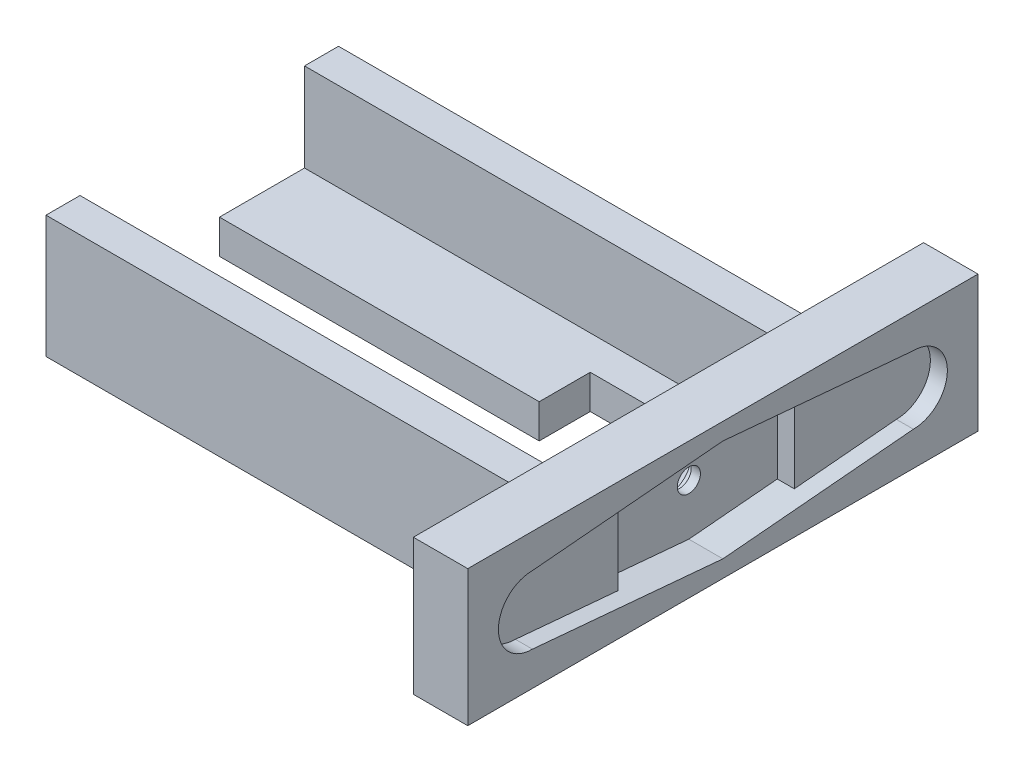
ISO-10303-21;
HEADER;
FILE_DESCRIPTION(('STEP AP214'),'2;1');
FILE_NAME('part.step','',(''),(''),'','','');
FILE_SCHEMA(('AUTOMOTIVE_DESIGN { 1 0 10303 214 1 1 1 1 }'));
ENDSEC;
DATA;
#1=APPLICATION_CONTEXT('core data for automotive mechanical design processes');
#2=APPLICATION_PROTOCOL_DEFINITION('international standard','automotive_design',2000,#1);
#3=PRODUCT_CONTEXT('',#1,'mechanical');
#4=PRODUCT('Part','Part','',(#3));
#5=PRODUCT_RELATED_PRODUCT_CATEGORY('part','',(#4));
#6=PRODUCT_DEFINITION_FORMATION('','',#4);
#7=PRODUCT_DEFINITION_CONTEXT('part definition',#1,'design');
#8=PRODUCT_DEFINITION('design','',#6,#7);
#9=PRODUCT_DEFINITION_SHAPE('','',#8);
#10=(LENGTH_UNIT() NAMED_UNIT(*) SI_UNIT(.MILLI.,.METRE.));
#11=(NAMED_UNIT(*) PLANE_ANGLE_UNIT() SI_UNIT($,.RADIAN.));
#12=(NAMED_UNIT(*) SI_UNIT($,.STERADIAN.) SOLID_ANGLE_UNIT());
#13=UNCERTAINTY_MEASURE_WITH_UNIT(LENGTH_MEASURE(1.E-05),#10,'distance_accuracy_value','');
#14=(GEOMETRIC_REPRESENTATION_CONTEXT(3) GLOBAL_UNCERTAINTY_ASSIGNED_CONTEXT((#13)) GLOBAL_UNIT_ASSIGNED_CONTEXT((#10,
#11,#12)) REPRESENTATION_CONTEXT('',''));
#15=CARTESIAN_POINT('',(0.,0.,0.));
#16=DIRECTION('',(0.,0.,1.));
#17=DIRECTION('',(1.,0.,0.));
#18=AXIS2_PLACEMENT_3D('',#15,#16,#17);
#19=CARTESIAN_POINT('',(-70.,-15.,-41.5));
#20=DIRECTION('',(0.,0.,-1.));
#21=DIRECTION('',(-1.,0.,0.));
#22=AXIS2_PLACEMENT_3D('',#19,#20,#21);
#23=PLANE('',#22);
#24=DIRECTION('',(1.,0.,0.));
#25=VECTOR('',#24,1.);
#26=CARTESIAN_POINT('',(0.,0.,-41.5));
#27=LINE('',#26,#25);
#28=CARTESIAN_POINT('',(-70.,0.,-41.5));
#29=VERTEX_POINT('',#28);
#30=CARTESIAN_POINT('',(-23.,0.,-41.5));
#31=VERTEX_POINT('',#30);
#32=EDGE_CURVE('E371',#29,#31,#27,.T.);
#33=ORIENTED_EDGE('',*,*,#32,.T.);
#34=DIRECTION('',(0.,1.,0.));
#35=VECTOR('',#34,1.);
#36=CARTESIAN_POINT('',(-23.,-15.,-41.5));
#37=LINE('',#36,#35);
#38=CARTESIAN_POINT('',(-23.,5.,-41.5));
#39=VERTEX_POINT('',#38);
#40=EDGE_CURVE('E335',#31,#39,#37,.T.);
#41=ORIENTED_EDGE('',*,*,#40,.T.);
#42=DIRECTION('',(-1.,0.,0.));
#43=VECTOR('',#42,1.);
#44=CARTESIAN_POINT('',(-70.,5.,-41.5));
#45=LINE('',#44,#43);
#46=CARTESIAN_POINT('',(-70.,5.,-41.5));
#47=VERTEX_POINT('',#46);
#48=EDGE_CURVE('E353',#39,#47,#45,.T.);
#49=ORIENTED_EDGE('',*,*,#48,.T.);
#50=DIRECTION('',(0.,-1.,0.));
#51=VECTOR('',#50,1.);
#52=CARTESIAN_POINT('',(-70.,0.,-41.5));
#53=LINE('',#52,#51);
#54=EDGE_CURVE('E614',#47,#29,#53,.T.);
#55=ORIENTED_EDGE('',*,*,#54,.T.);
#56=EDGE_LOOP('',(#33,#41,#49,#55));
#57=FACE_BOUND('',#56,.T.);
#58=ADVANCED_FACE('F55',(#57),#23,.F.);
#59=CARTESIAN_POINT('',(-70.,-15.,-33.5));
#60=DIRECTION('',(0.,0.,1.));
#61=DIRECTION('',(1.,0.,0.));
#62=AXIS2_PLACEMENT_3D('',#59,#60,#61);
#63=PLANE('',#62);
#64=DIRECTION('',(1.,0.,0.));
#65=VECTOR('',#64,1.);
#66=CARTESIAN_POINT('',(-70.,5.,-33.5));
#67=LINE('',#66,#65);
#68=CARTESIAN_POINT('',(-70.,5.,-33.5));
#69=VERTEX_POINT('',#68);
#70=CARTESIAN_POINT('',(-23.,5.,-33.5));
#71=VERTEX_POINT('',#70);
#72=EDGE_CURVE('E346',#69,#71,#67,.T.);
#73=ORIENTED_EDGE('',*,*,#72,.T.);
#74=DIRECTION('',(0.,-1.,0.));
#75=VECTOR('',#74,1.);
#76=CARTESIAN_POINT('',(-23.,-15.,-33.5));
#77=LINE('',#76,#75);
#78=CARTESIAN_POINT('',(-23.,0.,-33.5));
#79=VERTEX_POINT('',#78);
#80=EDGE_CURVE('E12',#71,#79,#77,.T.);
#81=ORIENTED_EDGE('',*,*,#80,.T.);
#82=DIRECTION('',(-1.,0.,0.));
#83=VECTOR('',#82,1.);
#84=CARTESIAN_POINT('',(0.,0.,-33.5));
#85=LINE('',#84,#83);
#86=CARTESIAN_POINT('',(-70.,0.,-33.5));
#87=VERTEX_POINT('',#86);
#88=EDGE_CURVE('E362',#79,#87,#85,.T.);
#89=ORIENTED_EDGE('',*,*,#88,.T.);
#90=DIRECTION('',(0.,1.,0.));
#91=VECTOR('',#90,1.);
#92=CARTESIAN_POINT('',(-70.,0.,-33.5));
#93=LINE('',#92,#91);
#94=EDGE_CURVE('E611',#87,#69,#93,.T.);
#95=ORIENTED_EDGE('',*,*,#94,.T.);
#96=EDGE_LOOP('',(#73,#81,#89,#95));
#97=FACE_BOUND('',#96,.T.);
#98=ADVANCED_FACE('F682',(#97),#63,.F.);
#99=CARTESIAN_POINT('',(-70.,0.,0.));
#100=DIRECTION('',(-1.,0.,0.));
#101=DIRECTION('',(0.,0.,1.));
#102=AXIS2_PLACEMENT_3D('',#99,#100,#101);
#103=PLANE('',#102);
#104=ORIENTED_EDGE('',*,*,#54,.F.);
#105=DIRECTION('',(0.,0.,-1.));
#106=VECTOR('',#105,1.);
#107=CARTESIAN_POINT('',(-70.,5.,-54.));
#108=LINE('',#107,#106);
#109=CARTESIAN_POINT('',(-70.,5.,-54.));
#110=VERTEX_POINT('',#109);
#111=EDGE_CURVE('E443',#47,#110,#108,.T.);
#112=ORIENTED_EDGE('',*,*,#111,.T.);
#113=DIRECTION('',(0.,1.,0.));
#114=VECTOR('',#113,1.);
#115=CARTESIAN_POINT('',(-70.,0.,-54.));
#116=LINE('',#115,#114);
#117=CARTESIAN_POINT('',(-70.,18.,-54.));
#118=VERTEX_POINT('',#117);
#119=EDGE_CURVE('E379',#110,#118,#116,.T.);
#120=ORIENTED_EDGE('',*,*,#119,.T.);
#121=DIRECTION('',(0.,0.,-1.));
#122=VECTOR('',#121,1.);
#123=CARTESIAN_POINT('',(-70.,18.,-54.));
#124=LINE('',#123,#122);
#125=CARTESIAN_POINT('',(-70.,18.,-59.));
#126=VERTEX_POINT('',#125);
#127=EDGE_CURVE('E382',#118,#126,#124,.T.);
#128=ORIENTED_EDGE('',*,*,#127,.T.);
#129=DIRECTION('',(0.,-1.,0.));
#130=VECTOR('',#129,1.);
#131=CARTESIAN_POINT('',(-70.,0.,-59.));
#132=LINE('',#131,#130);
#133=CARTESIAN_POINT('',(-70.,0.,-59.));
#134=VERTEX_POINT('',#133);
#135=EDGE_CURVE('E386',#126,#134,#132,.T.);
#136=ORIENTED_EDGE('',*,*,#135,.T.);
#137=DIRECTION('',(0.,0.,1.));
#138=VECTOR('',#137,1.);
#139=CARTESIAN_POINT('',(-70.,0.,-54.));
#140=LINE('',#139,#138);
#141=EDGE_CURVE('E439',#134,#29,#140,.T.);
#142=ORIENTED_EDGE('',*,*,#141,.T.);
#143=EDGE_LOOP('',(#104,#112,#120,#128,#136,#142));
#144=FACE_BOUND('',#143,.T.);
#145=ADVANCED_FACE('F651',(#144),#103,.T.);
#146=CARTESIAN_POINT('',(0.,20.,0.));
#147=DIRECTION('',(-1.,0.,0.));
#148=DIRECTION('',(0.,0.,1.));
#149=AXIS2_PLACEMENT_3D('',#146,#147,#148);
#150=PLANE('',#149);
#151=CARTESIAN_POINT('',(0.,10.,-37.5));
#152=DIRECTION('',(-1.,0.,0.));
#153=DIRECTION('',(0.,0.,1.));
#154=AXIS2_PLACEMENT_3D('',#151,#152,#153);
#155=CIRCLE('',#154,3.35);
#156=CARTESIAN_POINT('',(0.,10.,-34.15));
#157=VERTEX_POINT('',#156);
#158=EDGE_CURVE('E848',#157,#157,#155,.T.);
#159=ORIENTED_EDGE('',*,*,#158,.F.);
#160=EDGE_LOOP('',(#159));
#161=FACE_BOUND('',#160,.T.);
#162=DIRECTION('',(0.,0.,-1.));
#163=VECTOR('',#162,1.);
#164=CARTESIAN_POINT('',(0.,18.,-54.));
#165=LINE('',#164,#163);
#166=CARTESIAN_POINT('',(0.,18.,-54.));
#167=VERTEX_POINT('',#166);
#168=CARTESIAN_POINT('',(0.,18.,-59.));
#169=VERTEX_POINT('',#168);
#170=EDGE_CURVE('E393',#167,#169,#165,.T.);
#171=ORIENTED_EDGE('',*,*,#170,.F.);
#172=DIRECTION('',(0.,1.,0.));
#173=VECTOR('',#172,1.);
#174=CARTESIAN_POINT('',(0.,0.,-54.));
#175=LINE('',#174,#173);
#176=CARTESIAN_POINT('',(0.,5.,-54.));
#177=VERTEX_POINT('',#176);
#178=EDGE_CURVE('E378',#177,#167,#175,.T.);
#179=ORIENTED_EDGE('',*,*,#178,.F.);
#180=DIRECTION('',(0.,0.,-1.));
#181=VECTOR('',#180,1.);
#182=CARTESIAN_POINT('',(0.,5.,-54.));
#183=LINE('',#182,#181);
#184=CARTESIAN_POINT('',(0.,5.,-21.));
#185=VERTEX_POINT('',#184);
#186=EDGE_CURVE('E438',#185,#177,#183,.T.);
#187=ORIENTED_EDGE('',*,*,#186,.F.);
#188=DIRECTION('',(0.,-1.,0.));
#189=VECTOR('',#188,1.);
#190=CARTESIAN_POINT('',(0.,0.,-21.));
#191=LINE('',#190,#189);
#192=CARTESIAN_POINT('',(0.,18.,-21.));
#193=VERTEX_POINT('',#192);
#194=EDGE_CURVE('E409',#193,#185,#191,.T.);
#195=ORIENTED_EDGE('',*,*,#194,.F.);
#196=DIRECTION('',(0.,0.,-1.));
#197=VECTOR('',#196,1.);
#198=CARTESIAN_POINT('',(0.,18.,-21.));
#199=LINE('',#198,#197);
#200=CARTESIAN_POINT('',(0.,18.,-16.));
#201=VERTEX_POINT('',#200);
#202=EDGE_CURVE('E414',#201,#193,#199,.T.);
#203=ORIENTED_EDGE('',*,*,#202,.F.);
#204=DIRECTION('',(0.,1.,0.));
#205=VECTOR('',#204,1.);
#206=CARTESIAN_POINT('',(0.,0.,-16.));
#207=LINE('',#206,#205);
#208=CARTESIAN_POINT('',(0.,0.,-16.));
#209=VERTEX_POINT('',#208);
#210=EDGE_CURVE('E423',#209,#201,#207,.T.);
#211=ORIENTED_EDGE('',*,*,#210,.F.);
#212=DIRECTION('',(0.,0.,-1.));
#213=VECTOR('',#212,1.);
#214=CARTESIAN_POINT('',(0.,0.,0.));
#215=LINE('',#214,#213);
#216=CARTESIAN_POINT('',(0.,0.,0.));
#217=VERTEX_POINT('',#216);
#218=EDGE_CURVE('E588',#217,#209,#215,.T.);
#219=ORIENTED_EDGE('',*,*,#218,.F.);
#220=DIRECTION('',(0.,-1.,0.));
#221=VECTOR('',#220,1.);
#222=CARTESIAN_POINT('',(0.,20.,0.));
#223=LINE('',#222,#221);
#224=CARTESIAN_POINT('',(0.,20.,0.));
#225=VERTEX_POINT('',#224);
#226=EDGE_CURVE('E599',#225,#217,#223,.T.);
#227=ORIENTED_EDGE('',*,*,#226,.F.);
#228=DIRECTION('',(0.,0.,-1.));
#229=VECTOR('',#228,1.);
#230=CARTESIAN_POINT('',(0.,20.,0.));
#231=LINE('',#230,#229);
#232=CARTESIAN_POINT('',(0.,20.,-75.));
#233=VERTEX_POINT('',#232);
#234=EDGE_CURVE('E574',#225,#233,#231,.T.);
#235=ORIENTED_EDGE('',*,*,#234,.T.);
#236=DIRECTION('',(0.,-1.,0.));
#237=VECTOR('',#236,1.);
#238=CARTESIAN_POINT('',(0.,20.,-75.));
#239=LINE('',#238,#237);
#240=CARTESIAN_POINT('',(0.,0.,-75.));
#241=VERTEX_POINT('',#240);
#242=EDGE_CURVE('E587',#233,#241,#239,.T.);
#243=ORIENTED_EDGE('',*,*,#242,.T.);
#244=CARTESIAN_POINT('',(0.,0.,-59.));
#245=VERTEX_POINT('',#244);
#246=EDGE_CURVE('E573',#245,#241,#215,.T.);
#247=ORIENTED_EDGE('',*,*,#246,.F.);
#248=DIRECTION('',(0.,-1.,0.));
#249=VECTOR('',#248,1.);
#250=CARTESIAN_POINT('',(0.,0.,-59.));
#251=LINE('',#250,#249);
#252=EDGE_CURVE('E383',#169,#245,#251,.T.);
#253=ORIENTED_EDGE('',*,*,#252,.F.);
#254=EDGE_LOOP('',(#171,#179,#187,#195,#203,#211,#219,#227,#235,#243,#247,#253));
#255=FACE_BOUND('',#254,.T.);
#256=ADVANCED_FACE('F57',(#161,#255),#150,.T.);
#257=CARTESIAN_POINT('',(5.50000000000001,0.,0.));
#258=DIRECTION('',(1.,0.,0.));
#259=DIRECTION('',(0.,0.,-1.));
#260=AXIS2_PLACEMENT_3D('',#257,#258,#259);
#261=PLANE('',#260);
#262=DIRECTION('',(0.,-1.,0.));
#263=VECTOR('',#262,1.);
#264=CARTESIAN_POINT('',(5.50000000000001,0.,-24.551509830912));
#265=LINE('',#264,#263);
#266=CARTESIAN_POINT('',(5.50000000000001,16.3438848063314,-24.551509830912));
#267=VERTEX_POINT('',#266);
#268=CARTESIAN_POINT('',(5.50000000000001,3.65611519366857,-24.551509830912));
#269=VERTEX_POINT('',#268);
#270=EDGE_CURVE('E608',#267,#269,#265,.T.);
#271=ORIENTED_EDGE('',*,*,#270,.F.);
#272=DIRECTION('',(0.,0.0889319379745051,-0.996037705314462));
#273=VECTOR('',#272,1.);
#274=CARTESIAN_POINT('',(5.50000000000001,14.0398608035432,1.25355900031635));
#275=LINE('',#274,#273);
#276=CARTESIAN_POINT('',(5.50000000000001,15.,-9.5));
#277=VERTEX_POINT('',#276);
#278=EDGE_CURVE('E510',#277,#267,#275,.T.);
#279=ORIENTED_EDGE('',*,*,#278,.F.);
#280=CARTESIAN_POINT('',(5.50000000000001,10.,-9.5));
#281=DIRECTION('',(1.,0.,0.));
#282=DIRECTION('',(0.,0.,-1.));
#283=AXIS2_PLACEMENT_3D('',#280,#281,#282);
#284=CIRCLE('',#283,5.00000000000001);
#285=CARTESIAN_POINT('',(5.50000000000001,4.99999999999999,-9.5));
#286=VERTEX_POINT('',#285);
#287=EDGE_CURVE('E514',#286,#277,#284,.F.);
#288=ORIENTED_EDGE('',*,*,#287,.F.);
#289=DIRECTION('',(0.,0.0889319379745051,0.996037705314462));
#290=VECTOR('',#289,1.);
#291=CARTESIAN_POINT('',(5.50000000000001,5.80196140461878,-0.518032268269531));
#292=LINE('',#291,#290);
#293=EDGE_CURVE('E517',#269,#286,#292,.T.);
#294=ORIENTED_EDGE('',*,*,#293,.F.);
#295=EDGE_LOOP('',(#271,#279,#288,#294));
#296=FACE_BOUND('',#295,.T.);
#297=ADVANCED_FACE('F752',(#296),#261,.T.);
#298=CARTESIAN_POINT('',(8.00000000000001,0.,0.));
#299=DIRECTION('',(1.,0.,0.));
#300=DIRECTION('',(0.,0.,-1.));
#301=AXIS2_PLACEMENT_3D('',#298,#299,#300);
#302=PLANE('',#301);
#303=DIRECTION('',(0.,-1.,0.));
#304=VECTOR('',#303,1.);
#305=CARTESIAN_POINT('',(8.00000000000001,0.,0.));
#306=LINE('',#305,#304);
#307=CARTESIAN_POINT('',(8.00000000000001,20.,0.));
#308=VERTEX_POINT('',#307);
#309=CARTESIAN_POINT('',(8.00000000000001,0.,0.));
#310=VERTEX_POINT('',#309);
#311=EDGE_CURVE('E543',#308,#310,#306,.T.);
#312=ORIENTED_EDGE('',*,*,#311,.T.);
#313=DIRECTION('',(0.,0.,-1.));
#314=VECTOR('',#313,1.);
#315=CARTESIAN_POINT('',(8.00000000000001,0.,0.));
#316=LINE('',#315,#314);
#317=CARTESIAN_POINT('',(8.00000000000001,0.,-75.));
#318=VERTEX_POINT('',#317);
#319=EDGE_CURVE('E564',#310,#318,#316,.T.);
#320=ORIENTED_EDGE('',*,*,#319,.T.);
#321=DIRECTION('',(0.,1.,0.));
#322=VECTOR('',#321,1.);
#323=CARTESIAN_POINT('',(8.00000000000001,0.,-75.));
#324=LINE('',#323,#322);
#325=CARTESIAN_POINT('',(8.00000000000001,20.,-75.));
#326=VERTEX_POINT('',#325);
#327=EDGE_CURVE('E567',#318,#326,#324,.T.);
#328=ORIENTED_EDGE('',*,*,#327,.T.);
#329=DIRECTION('',(0.,0.,1.));
#330=VECTOR('',#329,1.);
#331=CARTESIAN_POINT('',(8.00000000000001,20.,0.));
#332=LINE('',#331,#330);
#333=EDGE_CURVE('E570',#326,#308,#332,.T.);
#334=ORIENTED_EDGE('',*,*,#333,.T.);
#335=EDGE_LOOP('',(#312,#320,#328,#334));
#336=FACE_BOUND('',#335,.T.);
#337=CARTESIAN_POINT('',(8.00000000000001,10.,-65.5));
#338=DIRECTION('',(1.,0.,0.));
#339=DIRECTION('',(0.,0.,-1.));
#340=AXIS2_PLACEMENT_3D('',#337,#338,#339);
#341=CIRCLE('',#340,4.99999999999999);
#342=CARTESIAN_POINT('',(8.00000000000001,5.00000000000001,-65.5));
#343=VERTEX_POINT('',#342);
#344=CARTESIAN_POINT('',(8.00000000000001,15.,-65.5));
#345=VERTEX_POINT('',#344);
#346=EDGE_CURVE('E523',#343,#345,#341,.T.);
#347=ORIENTED_EDGE('',*,*,#346,.F.);
#348=DIRECTION('',(0.,-0.0889319379745058,0.996037705314462));
#349=VECTOR('',#348,1.);
#350=CARTESIAN_POINT('',(8.00000000000001,-0.841505852578306,-0.0751344511230632));
#351=LINE('',#350,#349);
#352=CARTESIAN_POINT('',(8.00000000000001,2.5,-37.5));
#353=VERTEX_POINT('',#352);
#354=EDGE_CURVE('E488',#343,#353,#351,.T.);
#355=ORIENTED_EDGE('',*,*,#354,.T.);
#356=DIRECTION('',(0.,0.0889319379745051,0.996037705314462));
#357=VECTOR('',#356,1.);
#358=CARTESIAN_POINT('',(8.00000000000001,5.80196140461878,-0.518032268269531));
#359=LINE('',#358,#357);
#360=CARTESIAN_POINT('',(8.00000000000001,4.99999999999999,-9.5));
#361=VERTEX_POINT('',#360);
#362=EDGE_CURVE('E503',#353,#361,#359,.T.);
#363=ORIENTED_EDGE('',*,*,#362,.T.);
#364=CARTESIAN_POINT('',(8.00000000000001,10.,-9.5));
#365=DIRECTION('',(1.,0.,0.));
#366=DIRECTION('',(0.,0.,-1.));
#367=AXIS2_PLACEMENT_3D('',#364,#365,#366);
#368=CIRCLE('',#367,5.00000000000001);
#369=CARTESIAN_POINT('',(8.00000000000001,15.,-9.5));
#370=VERTEX_POINT('',#369);
#371=EDGE_CURVE('E533',#361,#370,#368,.F.);
#372=ORIENTED_EDGE('',*,*,#371,.T.);
#373=DIRECTION('',(0.,0.0889319379745051,-0.996037705314462));
#374=VECTOR('',#373,1.);
#375=CARTESIAN_POINT('',(8.00000000000001,14.0398608035432,1.25355900031635));
#376=LINE('',#375,#374);
#377=CARTESIAN_POINT('',(8.00000000000001,17.5,-37.5));
#378=VERTEX_POINT('',#377);
#379=EDGE_CURVE('E530',#370,#378,#376,.T.);
#380=ORIENTED_EDGE('',*,*,#379,.T.);
#381=DIRECTION('',(0.,-0.0889319379745058,-0.996037705314462));
#382=VECTOR('',#381,1.);
#383=CARTESIAN_POINT('',(8.00000000000001,20.6833280607403,-1.84672571970896));
#384=LINE('',#383,#382);
#385=EDGE_CURVE('E527',#378,#345,#384,.T.);
#386=ORIENTED_EDGE('',*,*,#385,.T.);
#387=EDGE_LOOP('',(#347,#355,#363,#372,#380,#386));
#388=FACE_BOUND('',#387,.T.);
#389=ADVANCED_FACE('F776',(#336,#388),#302,.T.);
#390=CARTESIAN_POINT('',(0.,20.,0.));
#391=DIRECTION('',(0.,0.,-1.));
#392=DIRECTION('',(-1.,0.,0.));
#393=AXIS2_PLACEMENT_3D('',#390,#391,#392);
#394=PLANE('',#393);
#395=ORIENTED_EDGE('',*,*,#311,.F.);
#396=DIRECTION('',(1.,0.,0.));
#397=VECTOR('',#396,1.);
#398=CARTESIAN_POINT('',(0.,20.,0.));
#399=LINE('',#398,#397);
#400=EDGE_CURVE('E583',#225,#308,#399,.T.);
#401=ORIENTED_EDGE('',*,*,#400,.F.);
#402=ORIENTED_EDGE('',*,*,#226,.T.);
#403=DIRECTION('',(1.,0.,0.));
#404=VECTOR('',#403,1.);
#405=CARTESIAN_POINT('',(0.,0.,0.));
#406=LINE('',#405,#404);
#407=EDGE_CURVE('E579',#217,#310,#406,.T.);
#408=ORIENTED_EDGE('',*,*,#407,.T.);
#409=EDGE_LOOP('',(#395,#401,#402,#408));
#410=FACE_BOUND('',#409,.T.);
#411=ADVANCED_FACE('F779',(#410),#394,.F.);
#412=CARTESIAN_POINT('',(0.,20.,-75.));
#413=DIRECTION('',(0.,0.,-1.));
#414=DIRECTION('',(-1.,0.,0.));
#415=AXIS2_PLACEMENT_3D('',#412,#413,#414);
#416=PLANE('',#415);
#417=DIRECTION('',(1.,0.,0.));
#418=VECTOR('',#417,1.);
#419=CARTESIAN_POINT('',(0.,20.,-75.));
#420=LINE('',#419,#418);
#421=EDGE_CURVE('E578',#233,#326,#420,.T.);
#422=ORIENTED_EDGE('',*,*,#421,.T.);
#423=ORIENTED_EDGE('',*,*,#327,.F.);
#424=DIRECTION('',(1.,0.,0.));
#425=VECTOR('',#424,1.);
#426=CARTESIAN_POINT('',(0.,0.,-75.));
#427=LINE('',#426,#425);
#428=EDGE_CURVE('E592',#241,#318,#427,.T.);
#429=ORIENTED_EDGE('',*,*,#428,.F.);
#430=ORIENTED_EDGE('',*,*,#242,.F.);
#431=EDGE_LOOP('',(#422,#423,#429,#430));
#432=FACE_BOUND('',#431,.T.);
#433=ADVANCED_FACE('F784',(#432),#416,.T.);
#434=CARTESIAN_POINT('',(0.,20.,0.));
#435=DIRECTION('',(0.,-1.,0.));
#436=DIRECTION('',(0.,0.,-1.));
#437=AXIS2_PLACEMENT_3D('',#434,#435,#436);
#438=PLANE('',#437);
#439=ORIENTED_EDGE('',*,*,#333,.F.);
#440=ORIENTED_EDGE('',*,*,#421,.F.);
#441=ORIENTED_EDGE('',*,*,#234,.F.);
#442=ORIENTED_EDGE('',*,*,#400,.T.);
#443=EDGE_LOOP('',(#439,#440,#441,#442));
#444=FACE_BOUND('',#443,.T.);
#445=ADVANCED_FACE('F781',(#444),#438,.F.);
#446=CARTESIAN_POINT('',(0.,0.,0.));
#447=DIRECTION('',(0.,-1.,0.));
#448=DIRECTION('',(0.,0.,-1.));
#449=AXIS2_PLACEMENT_3D('',#446,#447,#448);
#450=PLANE('',#449);
#451=DIRECTION('',(0.,0.,-1.));
#452=VECTOR('',#451,1.);
#453=CARTESIAN_POINT('',(-23.,0.,0.));
#454=LINE('',#453,#452);
#455=CARTESIAN_POINT('',(-23.,0.,-49.));
#456=VERTEX_POINT('',#455);
#457=EDGE_CURVE('E336',#31,#456,#454,.T.);
#458=ORIENTED_EDGE('',*,*,#457,.F.);
#459=ORIENTED_EDGE('',*,*,#32,.F.);
#460=ORIENTED_EDGE('',*,*,#141,.F.);
#461=DIRECTION('',(1.,0.,0.));
#462=VECTOR('',#461,1.);
#463=CARTESIAN_POINT('',(-70.,0.,-59.));
#464=LINE('',#463,#462);
#465=EDGE_CURVE('E390',#134,#245,#464,.T.);
#466=ORIENTED_EDGE('',*,*,#465,.T.);
#467=ORIENTED_EDGE('',*,*,#246,.T.);
#468=ORIENTED_EDGE('',*,*,#428,.T.);
#469=ORIENTED_EDGE('',*,*,#319,.F.);
#470=ORIENTED_EDGE('',*,*,#407,.F.);
#471=ORIENTED_EDGE('',*,*,#218,.T.);
#472=DIRECTION('',(1.,0.,0.));
#473=VECTOR('',#472,1.);
#474=CARTESIAN_POINT('',(-70.,0.,-16.));
#475=LINE('',#474,#473);
#476=CARTESIAN_POINT('',(-70.,0.,-16.));
#477=VERTEX_POINT('',#476);
#478=EDGE_CURVE('E435',#477,#209,#475,.T.);
#479=ORIENTED_EDGE('',*,*,#478,.F.);
#480=EDGE_CURVE('E444',#87,#477,#140,.T.);
#481=ORIENTED_EDGE('',*,*,#480,.F.);
#482=ORIENTED_EDGE('',*,*,#88,.F.);
#483=CARTESIAN_POINT('',(-23.,0.,-27.239319023099));
#484=VERTEX_POINT('',#483);
#485=EDGE_CURVE('E332',#484,#79,#454,.T.);
#486=ORIENTED_EDGE('',*,*,#485,.F.);
#487=DIRECTION('',(-1.,0.,0.));
#488=VECTOR('',#487,1.);
#489=CARTESIAN_POINT('',(0.,0.,-27.239319023099));
#490=LINE('',#489,#488);
#491=CARTESIAN_POINT('',(-13.,0.,-27.239319023099));
#492=VERTEX_POINT('',#491);
#493=EDGE_CURVE('E286',#492,#484,#490,.T.);
#494=ORIENTED_EDGE('',*,*,#493,.F.);
#495=DIRECTION('',(0.,0.,1.));
#496=VECTOR('',#495,1.);
#497=CARTESIAN_POINT('',(-13.,0.,0.));
#498=LINE('',#497,#496);
#499=CARTESIAN_POINT('',(-13.,0.,-33.5));
#500=VERTEX_POINT('',#499);
#501=EDGE_CURVE('E321',#500,#492,#498,.T.);
#502=ORIENTED_EDGE('',*,*,#501,.F.);
#503=CARTESIAN_POINT('',(-10.,0.,-33.5));
#504=VERTEX_POINT('',#503);
#505=EDGE_CURVE('E366',#504,#500,#85,.T.);
#506=ORIENTED_EDGE('',*,*,#505,.F.);
#507=DIRECTION('',(0.,0.,1.));
#508=VECTOR('',#507,1.);
#509=CARTESIAN_POINT('',(-10.,0.,0.));
#510=LINE('',#509,#508);
#511=CARTESIAN_POINT('',(-10.,0.,-41.5));
#512=VERTEX_POINT('',#511);
#513=EDGE_CURVE('E375',#512,#504,#510,.T.);
#514=ORIENTED_EDGE('',*,*,#513,.F.);
#515=CARTESIAN_POINT('',(-13.,0.,-41.5));
#516=VERTEX_POINT('',#515);
#517=EDGE_CURVE('E370',#516,#512,#27,.T.);
#518=ORIENTED_EDGE('',*,*,#517,.F.);
#519=CARTESIAN_POINT('',(-13.,0.,-49.));
#520=VERTEX_POINT('',#519);
#521=EDGE_CURVE('E72',#520,#516,#498,.T.);
#522=ORIENTED_EDGE('',*,*,#521,.F.);
#523=DIRECTION('',(1.,0.,0.));
#524=VECTOR('',#523,1.);
#525=CARTESIAN_POINT('',(0.,0.,-49.));
#526=LINE('',#525,#524);
#527=EDGE_CURVE('E342',#456,#520,#526,.T.);
#528=ORIENTED_EDGE('',*,*,#527,.F.);
#529=EDGE_LOOP('',(#458,#459,#460,#466,#467,#468,#469,#470,#471,#479,#481,#482,#486,#494,#502,
#506,#514,#518,#522,#528));
#530=FACE_BOUND('',#529,.T.);
#531=ADVANCED_FACE('F639',(#530),#450,.T.);
#532=CARTESIAN_POINT('',(5.50000000000001,-0.841505852578306,-0.0751344511230632));
#533=DIRECTION('',(0.,0.996037705314462,0.0889319379745058));
#534=DIRECTION('',(0.,-0.0889319379745058,0.996037705314462));
#535=AXIS2_PLACEMENT_3D('',#532,#533,#534);
#536=PLANE('',#535);
#537=DIRECTION('',(0.,-0.0889319379745058,0.996037705314462));
#538=VECTOR('',#537,1.);
#539=CARTESIAN_POINT('',(5.50000000000001,-0.841505852578306,-0.0751344511230632));
#540=LINE('',#539,#538);
#541=CARTESIAN_POINT('',(5.50000000000001,5.00000000000001,-65.5));
#542=VERTEX_POINT('',#541);
#543=CARTESIAN_POINT('',(5.50000000000001,3.66071428571429,-50.5));
#544=VERTEX_POINT('',#543);
#545=EDGE_CURVE('E498',#542,#544,#540,.T.);
#546=ORIENTED_EDGE('',*,*,#545,.T.);
#547=DIRECTION('',(1.,0.,0.));
#548=VECTOR('',#547,1.);
#549=CARTESIAN_POINT('',(3.00000000000001,3.66071428571429,-50.5));
#550=LINE('',#549,#548);
#551=CARTESIAN_POINT('',(3.00000000000001,3.66071428571429,-50.5));
#552=VERTEX_POINT('',#551);
#553=EDGE_CURVE('E483',#552,#544,#550,.T.);
#554=ORIENTED_EDGE('',*,*,#553,.F.);
#555=DIRECTION('',(0.,0.0889319379745059,-0.996037705314462));
#556=VECTOR('',#555,1.);
#557=CARTESIAN_POINT('',(3.00000000000001,2.5,-37.5));
#558=LINE('',#557,#556);
#559=CARTESIAN_POINT('',(3.00000000000001,2.5,-37.5));
#560=VERTEX_POINT('',#559);
#561=EDGE_CURVE('E459',#560,#552,#558,.T.);
#562=ORIENTED_EDGE('',*,*,#561,.F.);
#563=DIRECTION('',(1.,0.,0.));
#564=VECTOR('',#563,1.);
#565=CARTESIAN_POINT('',(5.50000000000001,2.5,-37.5));
#566=LINE('',#565,#564);
#567=EDGE_CURVE('E539',#560,#353,#566,.T.);
#568=ORIENTED_EDGE('',*,*,#567,.T.);
#569=ORIENTED_EDGE('',*,*,#354,.F.);
#570=DIRECTION('',(1.,0.,0.));
#571=VECTOR('',#570,1.);
#572=CARTESIAN_POINT('',(5.50000000000001,5.00000000000001,-65.5));
#573=LINE('',#572,#571);
#574=EDGE_CURVE('E520',#542,#343,#573,.T.);
#575=ORIENTED_EDGE('',*,*,#574,.F.);
#576=EDGE_LOOP('',(#546,#554,#562,#568,#569,#575));
#577=FACE_BOUND('',#576,.T.);
#578=ADVANCED_FACE('F757',(#577),#536,.T.);
#579=CARTESIAN_POINT('',(5.50000000000001,5.80196140461878,-0.518032268269531));
#580=DIRECTION('',(0.,0.996037705314462,-0.0889319379745051));
#581=DIRECTION('',(0.,0.0889319379745051,0.996037705314462));
#582=AXIS2_PLACEMENT_3D('',#579,#580,#581);
#583=PLANE('',#582);
#584=DIRECTION('',(1.,0.,0.));
#585=VECTOR('',#584,1.);
#586=CARTESIAN_POINT('',(5.50000000000001,4.99999999999999,-9.5));
#587=LINE('',#586,#585);
#588=EDGE_CURVE('E544',#286,#361,#587,.T.);
#589=ORIENTED_EDGE('',*,*,#588,.T.);
#590=ORIENTED_EDGE('',*,*,#362,.F.);
#591=ORIENTED_EDGE('',*,*,#567,.F.);
#592=DIRECTION('',(0.,-0.0889319379745051,-0.996037705314462));
#593=VECTOR('',#592,1.);
#594=CARTESIAN_POINT('',(3.00000000000001,3.65611519366857,-24.551509830912));
#595=LINE('',#594,#593);
#596=CARTESIAN_POINT('',(3.00000000000001,3.65611519366857,-24.551509830912));
#597=VERTEX_POINT('',#596);
#598=EDGE_CURVE('E479',#597,#560,#595,.T.);
#599=ORIENTED_EDGE('',*,*,#598,.F.);
#600=DIRECTION('',(1.,0.,0.));
#601=VECTOR('',#600,1.);
#602=CARTESIAN_POINT('',(3.00000000000001,3.65611519366857,-24.551509830912));
#603=LINE('',#602,#601);
#604=EDGE_CURVE('E484',#597,#269,#603,.T.);
#605=ORIENTED_EDGE('',*,*,#604,.T.);
#606=ORIENTED_EDGE('',*,*,#293,.T.);
#607=EDGE_LOOP('',(#589,#590,#591,#599,#605,#606));
#608=FACE_BOUND('',#607,.T.);
#609=ADVANCED_FACE('F753',(#608),#583,.T.);
#610=CARTESIAN_POINT('',(5.50000000000001,10.,-9.5));
#611=DIRECTION('',(1.,0.,0.));
#612=DIRECTION('',(0.,0.,-1.));
#613=AXIS2_PLACEMENT_3D('',#610,#611,#612);
#614=CYLINDRICAL_SURFACE('',#613,5.00000000000001);
#615=ORIENTED_EDGE('',*,*,#371,.F.);
#616=ORIENTED_EDGE('',*,*,#588,.F.);
#617=ORIENTED_EDGE('',*,*,#287,.T.);
#618=DIRECTION('',(1.,0.,0.));
#619=VECTOR('',#618,1.);
#620=CARTESIAN_POINT('',(5.50000000000001,15.,-9.5));
#621=LINE('',#620,#619);
#622=EDGE_CURVE('E548',#277,#370,#621,.T.);
#623=ORIENTED_EDGE('',*,*,#622,.T.);
#624=EDGE_LOOP('',(#615,#616,#617,#623));
#625=FACE_BOUND('',#624,.T.);
#626=ADVANCED_FACE('F756',(#625),#614,.F.);
#627=CARTESIAN_POINT('',(5.50000000000001,14.0398608035432,1.25355900031635));
#628=DIRECTION('',(0.,-0.996037705314462,-0.0889319379745051));
#629=DIRECTION('',(0.,0.0889319379745051,-0.996037705314462));
#630=AXIS2_PLACEMENT_3D('',#627,#628,#629);
#631=PLANE('',#630);
#632=ORIENTED_EDGE('',*,*,#278,.T.);
#633=DIRECTION('',(1.,0.,0.));
#634=VECTOR('',#633,1.);
#635=CARTESIAN_POINT('',(3.00000000000001,16.3438848063314,-24.551509830912));
#636=LINE('',#635,#634);
#637=CARTESIAN_POINT('',(3.00000000000001,16.3438848063314,-24.551509830912));
#638=VERTEX_POINT('',#637);
#639=EDGE_CURVE('E489',#638,#267,#636,.T.);
#640=ORIENTED_EDGE('',*,*,#639,.F.);
#641=DIRECTION('',(0.,-0.0889319379745054,0.996037705314462));
#642=VECTOR('',#641,1.);
#643=CARTESIAN_POINT('',(3.00000000000001,17.5,-37.5));
#644=LINE('',#643,#642);
#645=CARTESIAN_POINT('',(3.00000000000001,17.5,-37.5));
#646=VERTEX_POINT('',#645);
#647=EDGE_CURVE('E471',#646,#638,#644,.T.);
#648=ORIENTED_EDGE('',*,*,#647,.F.);
#649=DIRECTION('',(1.,0.,0.));
#650=VECTOR('',#649,1.);
#651=CARTESIAN_POINT('',(5.50000000000001,17.5,-37.5));
#652=LINE('',#651,#650);
#653=EDGE_CURVE('E551',#646,#378,#652,.T.);
#654=ORIENTED_EDGE('',*,*,#653,.T.);
#655=ORIENTED_EDGE('',*,*,#379,.F.);
#656=ORIENTED_EDGE('',*,*,#622,.F.);
#657=EDGE_LOOP('',(#632,#640,#648,#654,#655,#656));
#658=FACE_BOUND('',#657,.T.);
#659=ADVANCED_FACE('F761',(#658),#631,.T.);
#660=CARTESIAN_POINT('',(5.50000000000001,20.6833280607403,-1.84672571970896));
#661=DIRECTION('',(0.,-0.996037705314462,0.0889319379745058));
#662=DIRECTION('',(0.,-0.0889319379745058,-0.996037705314462));
#663=AXIS2_PLACEMENT_3D('',#660,#661,#662);
#664=PLANE('',#663);
#665=DIRECTION('',(1.,0.,0.));
#666=VECTOR('',#665,1.);
#667=CARTESIAN_POINT('',(5.50000000000001,15.,-65.5));
#668=LINE('',#667,#666);
#669=CARTESIAN_POINT('',(5.50000000000001,15.,-65.5));
#670=VERTEX_POINT('',#669);
#671=EDGE_CURVE('E555',#670,#345,#668,.T.);
#672=ORIENTED_EDGE('',*,*,#671,.T.);
#673=ORIENTED_EDGE('',*,*,#385,.F.);
#674=ORIENTED_EDGE('',*,*,#653,.F.);
#675=DIRECTION('',(0.,0.0889319379745058,0.996037705314462));
#676=VECTOR('',#675,1.);
#677=CARTESIAN_POINT('',(3.00000000000001,16.3392857142857,-50.5));
#678=LINE('',#677,#676);
#679=CARTESIAN_POINT('',(3.00000000000001,16.3392857142857,-50.5));
#680=VERTEX_POINT('',#679);
#681=EDGE_CURVE('E467',#680,#646,#678,.T.);
#682=ORIENTED_EDGE('',*,*,#681,.F.);
#683=DIRECTION('',(1.,0.,0.));
#684=VECTOR('',#683,1.);
#685=CARTESIAN_POINT('',(3.00000000000001,16.3392857142857,-50.5));
#686=LINE('',#685,#684);
#687=CARTESIAN_POINT('',(5.50000000000001,16.3392857142857,-50.5));
#688=VERTEX_POINT('',#687);
#689=EDGE_CURVE('E492',#680,#688,#686,.T.);
#690=ORIENTED_EDGE('',*,*,#689,.T.);
#691=DIRECTION('',(0.,-0.0889319379745058,-0.996037705314462));
#692=VECTOR('',#691,1.);
#693=CARTESIAN_POINT('',(5.50000000000001,20.6833280607403,-1.84672571970896));
#694=LINE('',#693,#692);
#695=EDGE_CURVE('E507',#688,#670,#694,.T.);
#696=ORIENTED_EDGE('',*,*,#695,.T.);
#697=EDGE_LOOP('',(#672,#673,#674,#682,#690,#696));
#698=FACE_BOUND('',#697,.T.);
#699=ADVANCED_FACE('F765',(#698),#664,.T.);
#700=CARTESIAN_POINT('',(5.50000000000001,10.,-65.5));
#701=DIRECTION('',(1.,0.,0.));
#702=DIRECTION('',(0.,0.,-1.));
#703=AXIS2_PLACEMENT_3D('',#700,#701,#702);
#704=CYLINDRICAL_SURFACE('',#703,4.99999999999999);
#705=ORIENTED_EDGE('',*,*,#346,.T.);
#706=ORIENTED_EDGE('',*,*,#671,.F.);
#707=CARTESIAN_POINT('',(5.50000000000001,10.,-65.5));
#708=DIRECTION('',(1.,0.,0.));
#709=DIRECTION('',(0.,0.,-1.));
#710=AXIS2_PLACEMENT_3D('',#707,#708,#709);
#711=CIRCLE('',#710,4.99999999999999);
#712=EDGE_CURVE('E502',#542,#670,#711,.T.);
#713=ORIENTED_EDGE('',*,*,#712,.F.);
#714=ORIENTED_EDGE('',*,*,#574,.T.);
#715=EDGE_LOOP('',(#705,#706,#713,#714));
#716=FACE_BOUND('',#715,.T.);
#717=ADVANCED_FACE('F750',(#716),#704,.F.);
#718=DIRECTION('',(0.,1.,0.));
#719=VECTOR('',#718,1.);
#720=CARTESIAN_POINT('',(5.50000000000001,0.,-50.5));
#721=LINE('',#720,#719);
#722=EDGE_CURVE('E602',#544,#688,#721,.T.);
#723=ORIENTED_EDGE('',*,*,#722,.F.);
#724=ORIENTED_EDGE('',*,*,#545,.F.);
#725=ORIENTED_EDGE('',*,*,#712,.T.);
#726=ORIENTED_EDGE('',*,*,#695,.F.);
#727=EDGE_LOOP('',(#723,#724,#725,#726));
#728=FACE_BOUND('',#727,.T.);
#729=ADVANCED_FACE('F743',(#728),#261,.T.);
#730=CARTESIAN_POINT('',(3.00000000000001,16.3438848063314,-24.551509830912));
#731=DIRECTION('',(0.,0.,1.));
#732=DIRECTION('',(1.,0.,0.));
#733=AXIS2_PLACEMENT_3D('',#730,#731,#732);
#734=PLANE('',#733);
#735=ORIENTED_EDGE('',*,*,#270,.T.);
#736=ORIENTED_EDGE('',*,*,#604,.F.);
#737=DIRECTION('',(0.,-1.,0.));
#738=VECTOR('',#737,1.);
#739=CARTESIAN_POINT('',(3.00000000000001,16.3438848063314,-24.551509830912));
#740=LINE('',#739,#738);
#741=EDGE_CURVE('E475',#638,#597,#740,.T.);
#742=ORIENTED_EDGE('',*,*,#741,.F.);
#743=ORIENTED_EDGE('',*,*,#639,.T.);
#744=EDGE_LOOP('',(#735,#736,#742,#743));
#745=FACE_BOUND('',#744,.T.);
#746=ADVANCED_FACE('F740',(#745),#734,.F.);
#747=CARTESIAN_POINT('',(3.00000000000001,3.66071428571429,-50.5));
#748=DIRECTION('',(0.,0.,-1.));
#749=DIRECTION('',(-1.,0.,0.));
#750=AXIS2_PLACEMENT_3D('',#747,#748,#749);
#751=PLANE('',#750);
#752=ORIENTED_EDGE('',*,*,#722,.T.);
#753=ORIENTED_EDGE('',*,*,#689,.F.);
#754=DIRECTION('',(0.,1.,0.));
#755=VECTOR('',#754,1.);
#756=CARTESIAN_POINT('',(3.00000000000001,3.66071428571429,-50.5));
#757=LINE('',#756,#755);
#758=EDGE_CURVE('E463',#552,#680,#757,.T.);
#759=ORIENTED_EDGE('',*,*,#758,.F.);
#760=ORIENTED_EDGE('',*,*,#553,.T.);
#761=EDGE_LOOP('',(#752,#753,#759,#760));
#762=FACE_BOUND('',#761,.T.);
#763=ADVANCED_FACE('F738',(#762),#751,.F.);
#764=CARTESIAN_POINT('',(3.00000000000001,0.,0.));
#765=DIRECTION('',(1.,0.,0.));
#766=DIRECTION('',(0.,0.,-1.));
#767=AXIS2_PLACEMENT_3D('',#764,#765,#766);
#768=PLANE('',#767);
#769=CARTESIAN_POINT('',(3.00000000000001,10.,-37.5));
#770=DIRECTION('',(1.,0.,0.));
#771=DIRECTION('',(0.,0.,-1.));
#772=AXIS2_PLACEMENT_3D('',#769,#770,#771);
#773=CIRCLE('',#772,1.7);
#774=CARTESIAN_POINT('',(3.00000000000001,10.,-39.2));
#775=VERTEX_POINT('',#774);
#776=EDGE_CURVE('E59',#775,#775,#773,.T.);
#777=ORIENTED_EDGE('',*,*,#776,.F.);
#778=EDGE_LOOP('',(#777));
#779=FACE_BOUND('',#778,.T.);
#780=ORIENTED_EDGE('',*,*,#561,.T.);
#781=ORIENTED_EDGE('',*,*,#758,.T.);
#782=ORIENTED_EDGE('',*,*,#681,.T.);
#783=ORIENTED_EDGE('',*,*,#647,.T.);
#784=ORIENTED_EDGE('',*,*,#741,.T.);
#785=ORIENTED_EDGE('',*,*,#598,.T.);
#786=EDGE_LOOP('',(#780,#781,#782,#783,#784,#785));
#787=FACE_BOUND('',#786,.T.);
#788=ADVANCED_FACE('F735',(#779,#787),#768,.T.);
#789=CARTESIAN_POINT('',(-70.,5.,-54.));
#790=DIRECTION('',(0.,-1.,0.));
#791=DIRECTION('',(0.,0.,-1.));
#792=AXIS2_PLACEMENT_3D('',#789,#790,#791);
#793=PLANE('',#792);
#794=ORIENTED_EDGE('',*,*,#48,.F.);
#795=DIRECTION('',(0.,0.,1.));
#796=VECTOR('',#795,1.);
#797=CARTESIAN_POINT('',(-23.,5.,-49.));
#798=LINE('',#797,#796);
#799=CARTESIAN_POINT('',(-23.,5.,-49.));
#800=VERTEX_POINT('',#799);
#801=EDGE_CURVE('E300',#800,#39,#798,.T.);
#802=ORIENTED_EDGE('',*,*,#801,.F.);
#803=DIRECTION('',(-1.,0.,0.));
#804=VECTOR('',#803,1.);
#805=CARTESIAN_POINT('',(-23.,5.,-49.));
#806=LINE('',#805,#804);
#807=CARTESIAN_POINT('',(-13.,5.,-49.));
#808=VERTEX_POINT('',#807);
#809=EDGE_CURVE('E291',#808,#800,#806,.T.);
#810=ORIENTED_EDGE('',*,*,#809,.F.);
#811=DIRECTION('',(0.,0.,-1.));
#812=VECTOR('',#811,1.);
#813=CARTESIAN_POINT('',(-13.,5.,-49.));
#814=LINE('',#813,#812);
#815=CARTESIAN_POINT('',(-13.,5.,-41.5));
#816=VERTEX_POINT('',#815);
#817=EDGE_CURVE('E306',#816,#808,#814,.T.);
#818=ORIENTED_EDGE('',*,*,#817,.F.);
#819=CARTESIAN_POINT('',(-10.,5.,-41.5));
#820=VERTEX_POINT('',#819);
#821=EDGE_CURVE('E354',#820,#816,#45,.T.);
#822=ORIENTED_EDGE('',*,*,#821,.F.);
#823=DIRECTION('',(0.,0.,-1.));
#824=VECTOR('',#823,1.);
#825=CARTESIAN_POINT('',(-10.,5.,-41.5));
#826=LINE('',#825,#824);
#827=CARTESIAN_POINT('',(-10.,5.,-33.5));
#828=VERTEX_POINT('',#827);
#829=EDGE_CURVE('E349',#828,#820,#826,.T.);
#830=ORIENTED_EDGE('',*,*,#829,.F.);
#831=CARTESIAN_POINT('',(-13.,5.,-33.5));
#832=VERTEX_POINT('',#831);
#833=EDGE_CURVE('E345',#832,#828,#67,.T.);
#834=ORIENTED_EDGE('',*,*,#833,.F.);
#835=CARTESIAN_POINT('',(-13.,5.,-27.239319023099));
#836=VERTEX_POINT('',#835);
#837=EDGE_CURVE('E80',#836,#832,#814,.T.);
#838=ORIENTED_EDGE('',*,*,#837,.F.);
#839=DIRECTION('',(1.,0.,0.));
#840=VECTOR('',#839,1.);
#841=CARTESIAN_POINT('',(-23.,5.,-27.239319023099));
#842=LINE('',#841,#840);
#843=CARTESIAN_POINT('',(-23.,5.,-27.239319023099));
#844=VERTEX_POINT('',#843);
#845=EDGE_CURVE('E284',#844,#836,#842,.T.);
#846=ORIENTED_EDGE('',*,*,#845,.F.);
#847=EDGE_CURVE('E294',#71,#844,#798,.T.);
#848=ORIENTED_EDGE('',*,*,#847,.F.);
#849=ORIENTED_EDGE('',*,*,#72,.F.);
#850=CARTESIAN_POINT('',(-70.,5.,-21.));
#851=VERTEX_POINT('',#850);
#852=EDGE_CURVE('E445',#851,#69,#108,.T.);
#853=ORIENTED_EDGE('',*,*,#852,.F.);
#854=DIRECTION('',(1.,0.,0.));
#855=VECTOR('',#854,1.);
#856=CARTESIAN_POINT('',(-70.,5.,-21.));
#857=LINE('',#856,#855);
#858=EDGE_CURVE('E455',#851,#185,#857,.T.);
#859=ORIENTED_EDGE('',*,*,#858,.T.);
#860=ORIENTED_EDGE('',*,*,#186,.T.);
#861=DIRECTION('',(1.,0.,0.));
#862=VECTOR('',#861,1.);
#863=CARTESIAN_POINT('',(-70.,5.,-54.));
#864=LINE('',#863,#862);
#865=EDGE_CURVE('E449',#110,#177,#864,.T.);
#866=ORIENTED_EDGE('',*,*,#865,.F.);
#867=ORIENTED_EDGE('',*,*,#111,.F.);
#868=EDGE_LOOP('',(#794,#802,#810,#818,#822,#830,#834,#838,#846,#848,#849,#853,#859,#860,#866,#867));
#869=FACE_BOUND('',#868,.T.);
#870=ADVANCED_FACE('F303',(#869),#793,.F.);
#871=ORIENTED_EDGE('',*,*,#94,.F.);
#872=ORIENTED_EDGE('',*,*,#480,.T.);
#873=DIRECTION('',(0.,1.,0.));
#874=VECTOR('',#873,1.);
#875=CARTESIAN_POINT('',(-70.,0.,-16.));
#876=LINE('',#875,#874);
#877=CARTESIAN_POINT('',(-70.,18.,-16.));
#878=VERTEX_POINT('',#877);
#879=EDGE_CURVE('E413',#477,#878,#876,.T.);
#880=ORIENTED_EDGE('',*,*,#879,.T.);
#881=DIRECTION('',(0.,0.,-1.));
#882=VECTOR('',#881,1.);
#883=CARTESIAN_POINT('',(-70.,18.,-21.));
#884=LINE('',#883,#882);
#885=CARTESIAN_POINT('',(-70.,18.,-21.));
#886=VERTEX_POINT('',#885);
#887=EDGE_CURVE('E417',#878,#886,#884,.T.);
#888=ORIENTED_EDGE('',*,*,#887,.T.);
#889=DIRECTION('',(0.,-1.,0.));
#890=VECTOR('',#889,1.);
#891=CARTESIAN_POINT('',(-70.,0.,-21.));
#892=LINE('',#891,#890);
#893=EDGE_CURVE('E410',#886,#851,#892,.T.);
#894=ORIENTED_EDGE('',*,*,#893,.T.);
#895=ORIENTED_EDGE('',*,*,#852,.T.);
#896=EDGE_LOOP('',(#871,#872,#880,#888,#894,#895));
#897=FACE_BOUND('',#896,.T.);
#898=ADVANCED_FACE('F660',(#897),#103,.T.);
#899=CARTESIAN_POINT('',(-70.,0.,-21.));
#900=DIRECTION('',(0.,0.,1.));
#901=DIRECTION('',(1.,0.,0.));
#902=AXIS2_PLACEMENT_3D('',#899,#900,#901);
#903=PLANE('',#902);
#904=ORIENTED_EDGE('',*,*,#194,.T.);
#905=ORIENTED_EDGE('',*,*,#858,.F.);
#906=ORIENTED_EDGE('',*,*,#893,.F.);
#907=DIRECTION('',(1.,0.,0.));
#908=VECTOR('',#907,1.);
#909=CARTESIAN_POINT('',(-70.,18.,-21.));
#910=LINE('',#909,#908);
#911=EDGE_CURVE('E420',#886,#193,#910,.T.);
#912=ORIENTED_EDGE('',*,*,#911,.T.);
#913=EDGE_LOOP('',(#904,#905,#906,#912));
#914=FACE_BOUND('',#913,.T.);
#915=ADVANCED_FACE('F678',(#914),#903,.F.);
#916=CARTESIAN_POINT('',(-70.,0.,-16.));
#917=DIRECTION('',(0.,0.,-1.));
#918=DIRECTION('',(-1.,0.,0.));
#919=AXIS2_PLACEMENT_3D('',#916,#917,#918);
#920=PLANE('',#919);
#921=ORIENTED_EDGE('',*,*,#210,.T.);
#922=DIRECTION('',(1.,0.,0.));
#923=VECTOR('',#922,1.);
#924=CARTESIAN_POINT('',(-70.,18.,-16.));
#925=LINE('',#924,#923);
#926=EDGE_CURVE('E431',#878,#201,#925,.T.);
#927=ORIENTED_EDGE('',*,*,#926,.F.);
#928=ORIENTED_EDGE('',*,*,#879,.F.);
#929=ORIENTED_EDGE('',*,*,#478,.T.);
#930=EDGE_LOOP('',(#921,#927,#928,#929));
#931=FACE_BOUND('',#930,.T.);
#932=ADVANCED_FACE('F668',(#931),#920,.F.);
#933=CARTESIAN_POINT('',(-70.,18.,-21.));
#934=DIRECTION('',(0.,-1.,0.));
#935=DIRECTION('',(0.,0.,-1.));
#936=AXIS2_PLACEMENT_3D('',#933,#934,#935);
#937=PLANE('',#936);
#938=ORIENTED_EDGE('',*,*,#202,.T.);
#939=ORIENTED_EDGE('',*,*,#911,.F.);
#940=ORIENTED_EDGE('',*,*,#887,.F.);
#941=ORIENTED_EDGE('',*,*,#926,.T.);
#942=EDGE_LOOP('',(#938,#939,#940,#941));
#943=FACE_BOUND('',#942,.T.);
#944=ADVANCED_FACE('F673',(#943),#937,.F.);
#945=CARTESIAN_POINT('',(-70.,0.,-54.));
#946=DIRECTION('',(0.,0.,-1.));
#947=DIRECTION('',(-1.,0.,0.));
#948=AXIS2_PLACEMENT_3D('',#945,#946,#947);
#949=PLANE('',#948);
#950=ORIENTED_EDGE('',*,*,#119,.F.);
#951=ORIENTED_EDGE('',*,*,#865,.T.);
#952=ORIENTED_EDGE('',*,*,#178,.T.);
#953=DIRECTION('',(1.,0.,0.));
#954=VECTOR('',#953,1.);
#955=CARTESIAN_POINT('',(-70.,18.,-54.));
#956=LINE('',#955,#954);
#957=EDGE_CURVE('E405',#118,#167,#956,.T.);
#958=ORIENTED_EDGE('',*,*,#957,.F.);
#959=EDGE_LOOP('',(#950,#951,#952,#958));
#960=FACE_BOUND('',#959,.T.);
#961=ADVANCED_FACE('F718',(#960),#949,.F.);
#962=CARTESIAN_POINT('',(-70.,18.,-54.));
#963=DIRECTION('',(0.,-1.,0.));
#964=DIRECTION('',(0.,0.,-1.));
#965=AXIS2_PLACEMENT_3D('',#962,#963,#964);
#966=PLANE('',#965);
#967=ORIENTED_EDGE('',*,*,#170,.T.);
#968=DIRECTION('',(1.,0.,0.));
#969=VECTOR('',#968,1.);
#970=CARTESIAN_POINT('',(-70.,18.,-59.));
#971=LINE('',#970,#969);
#972=EDGE_CURVE('E401',#126,#169,#971,.T.);
#973=ORIENTED_EDGE('',*,*,#972,.F.);
#974=ORIENTED_EDGE('',*,*,#127,.F.);
#975=ORIENTED_EDGE('',*,*,#957,.T.);
#976=EDGE_LOOP('',(#967,#973,#974,#975));
#977=FACE_BOUND('',#976,.T.);
#978=ADVANCED_FACE('F711',(#977),#966,.F.);
#979=CARTESIAN_POINT('',(-70.,0.,-59.));
#980=DIRECTION('',(0.,0.,1.));
#981=DIRECTION('',(1.,0.,0.));
#982=AXIS2_PLACEMENT_3D('',#979,#980,#981);
#983=PLANE('',#982);
#984=ORIENTED_EDGE('',*,*,#252,.T.);
#985=ORIENTED_EDGE('',*,*,#465,.F.);
#986=ORIENTED_EDGE('',*,*,#135,.F.);
#987=ORIENTED_EDGE('',*,*,#972,.T.);
#988=EDGE_LOOP('',(#984,#985,#986,#987));
#989=FACE_BOUND('',#988,.T.);
#990=ADVANCED_FACE('F705',(#989),#983,.F.);
#991=ORIENTED_EDGE('',*,*,#821,.T.);
#992=DIRECTION('',(0.,-1.,0.));
#993=VECTOR('',#992,1.);
#994=CARTESIAN_POINT('',(-13.,-15.,-41.5));
#995=LINE('',#994,#993);
#996=EDGE_CURVE('E329',#816,#516,#995,.T.);
#997=ORIENTED_EDGE('',*,*,#996,.T.);
#998=ORIENTED_EDGE('',*,*,#517,.T.);
#999=DIRECTION('',(0.,1.,0.));
#1000=VECTOR('',#999,1.);
#1001=CARTESIAN_POINT('',(-10.,-15.,-41.5));
#1002=LINE('',#1001,#1000);
#1003=EDGE_CURVE('E359',#512,#820,#1002,.T.);
#1004=ORIENTED_EDGE('',*,*,#1003,.T.);
#1005=EDGE_LOOP('',(#991,#997,#998,#1004));
#1006=FACE_BOUND('',#1005,.T.);
#1007=ADVANCED_FACE('F697',(#1006),#23,.F.);
#1008=CARTESIAN_POINT('',(-10.,-15.,-41.5));
#1009=DIRECTION('',(1.,0.,0.));
#1010=DIRECTION('',(0.,0.,-1.));
#1011=AXIS2_PLACEMENT_3D('',#1008,#1009,#1010);
#1012=PLANE('',#1011);
#1013=ORIENTED_EDGE('',*,*,#513,.T.);
#1014=DIRECTION('',(0.,1.,0.));
#1015=VECTOR('',#1014,1.);
#1016=CARTESIAN_POINT('',(-10.,-15.,-33.5));
#1017=LINE('',#1016,#1015);
#1018=EDGE_CURVE('E358',#504,#828,#1017,.T.);
#1019=ORIENTED_EDGE('',*,*,#1018,.T.);
#1020=ORIENTED_EDGE('',*,*,#829,.T.);
#1021=ORIENTED_EDGE('',*,*,#1003,.F.);
#1022=EDGE_LOOP('',(#1013,#1019,#1020,#1021));
#1023=FACE_BOUND('',#1022,.T.);
#1024=ADVANCED_FACE('F704',(#1023),#1012,.F.);
#1025=ORIENTED_EDGE('',*,*,#505,.T.);
#1026=DIRECTION('',(0.,1.,0.));
#1027=VECTOR('',#1026,1.);
#1028=CARTESIAN_POINT('',(-13.,-15.,-33.5));
#1029=LINE('',#1028,#1027);
#1030=EDGE_CURVE('E65',#500,#832,#1029,.T.);
#1031=ORIENTED_EDGE('',*,*,#1030,.T.);
#1032=ORIENTED_EDGE('',*,*,#833,.T.);
#1033=ORIENTED_EDGE('',*,*,#1018,.F.);
#1034=EDGE_LOOP('',(#1025,#1031,#1032,#1033));
#1035=FACE_BOUND('',#1034,.T.);
#1036=ADVANCED_FACE('F619',(#1035),#63,.F.);
#1037=CARTESIAN_POINT('',(-23.,-15.,-49.));
#1038=DIRECTION('',(-1.,0.,0.));
#1039=DIRECTION('',(0.,0.,1.));
#1040=AXIS2_PLACEMENT_3D('',#1037,#1038,#1039);
#1041=PLANE('',#1040);
#1042=ORIENTED_EDGE('',*,*,#485,.T.);
#1043=ORIENTED_EDGE('',*,*,#80,.F.);
#1044=ORIENTED_EDGE('',*,*,#847,.T.);
#1045=DIRECTION('',(0.,1.,0.));
#1046=VECTOR('',#1045,1.);
#1047=CARTESIAN_POINT('',(-23.,-15.,-27.239319023099));
#1048=LINE('',#1047,#1046);
#1049=EDGE_CURVE('E279',#484,#844,#1048,.T.);
#1050=ORIENTED_EDGE('',*,*,#1049,.F.);
#1051=EDGE_LOOP('',(#1042,#1043,#1044,#1050));
#1052=FACE_BOUND('',#1051,.T.);
#1053=ADVANCED_FACE('F295',(#1052),#1041,.F.);
#1054=CARTESIAN_POINT('',(-13.,-15.,-49.));
#1055=DIRECTION('',(1.,0.,0.));
#1056=DIRECTION('',(0.,0.,-1.));
#1057=AXIS2_PLACEMENT_3D('',#1054,#1055,#1056);
#1058=PLANE('',#1057);
#1059=ORIENTED_EDGE('',*,*,#501,.T.);
#1060=DIRECTION('',(0.,1.,0.));
#1061=VECTOR('',#1060,1.);
#1062=CARTESIAN_POINT('',(-13.,-15.,-27.239319023099));
#1063=LINE('',#1062,#1061);
#1064=EDGE_CURVE('E290',#492,#836,#1063,.T.);
#1065=ORIENTED_EDGE('',*,*,#1064,.T.);
#1066=ORIENTED_EDGE('',*,*,#837,.T.);
#1067=ORIENTED_EDGE('',*,*,#1030,.F.);
#1068=EDGE_LOOP('',(#1059,#1065,#1066,#1067));
#1069=FACE_BOUND('',#1068,.T.);
#1070=ADVANCED_FACE('F683',(#1069),#1058,.F.);
#1071=CARTESIAN_POINT('',(-23.,-15.,-27.239319023099));
#1072=DIRECTION('',(0.,0.,1.));
#1073=DIRECTION('',(1.,0.,0.));
#1074=AXIS2_PLACEMENT_3D('',#1071,#1072,#1073);
#1075=PLANE('',#1074);
#1076=ORIENTED_EDGE('',*,*,#493,.T.);
#1077=ORIENTED_EDGE('',*,*,#1049,.T.);
#1078=ORIENTED_EDGE('',*,*,#845,.T.);
#1079=ORIENTED_EDGE('',*,*,#1064,.F.);
#1080=EDGE_LOOP('',(#1076,#1077,#1078,#1079));
#1081=FACE_BOUND('',#1080,.T.);
#1082=ADVANCED_FACE('F281',(#1081),#1075,.F.);
#1083=ORIENTED_EDGE('',*,*,#457,.T.);
#1084=DIRECTION('',(0.,1.,0.));
#1085=VECTOR('',#1084,1.);
#1086=CARTESIAN_POINT('',(-23.,-15.,-49.));
#1087=LINE('',#1086,#1085);
#1088=EDGE_CURVE('E318',#456,#800,#1087,.T.);
#1089=ORIENTED_EDGE('',*,*,#1088,.T.);
#1090=ORIENTED_EDGE('',*,*,#801,.T.);
#1091=ORIENTED_EDGE('',*,*,#40,.F.);
#1092=EDGE_LOOP('',(#1083,#1089,#1090,#1091));
#1093=FACE_BOUND('',#1092,.T.);
#1094=ADVANCED_FACE('F631',(#1093),#1041,.F.);
#1095=ORIENTED_EDGE('',*,*,#521,.T.);
#1096=ORIENTED_EDGE('',*,*,#996,.F.);
#1097=ORIENTED_EDGE('',*,*,#817,.T.);
#1098=DIRECTION('',(0.,1.,0.));
#1099=VECTOR('',#1098,1.);
#1100=CARTESIAN_POINT('',(-13.,-15.,-49.));
#1101=LINE('',#1100,#1099);
#1102=EDGE_CURVE('E322',#520,#808,#1101,.T.);
#1103=ORIENTED_EDGE('',*,*,#1102,.F.);
#1104=EDGE_LOOP('',(#1095,#1096,#1097,#1103));
#1105=FACE_BOUND('',#1104,.T.);
#1106=ADVANCED_FACE('F686',(#1105),#1058,.F.);
#1107=CARTESIAN_POINT('',(-23.,-15.,-49.));
#1108=DIRECTION('',(0.,0.,-1.));
#1109=DIRECTION('',(-1.,0.,0.));
#1110=AXIS2_PLACEMENT_3D('',#1107,#1108,#1109);
#1111=PLANE('',#1110);
#1112=ORIENTED_EDGE('',*,*,#527,.T.);
#1113=ORIENTED_EDGE('',*,*,#1102,.T.);
#1114=ORIENTED_EDGE('',*,*,#809,.T.);
#1115=ORIENTED_EDGE('',*,*,#1088,.F.);
#1116=EDGE_LOOP('',(#1112,#1113,#1114,#1115));
#1117=FACE_BOUND('',#1116,.T.);
#1118=ADVANCED_FACE('F636',(#1117),#1111,.F.);
#1119=CARTESIAN_POINT('',(0.,10.,-37.5));
#1120=DIRECTION('',(-1.,0.,0.));
#1121=DIRECTION('',(0.,0.,1.));
#1122=AXIS2_PLACEMENT_3D('',#1119,#1120,#1121);
#1123=CYLINDRICAL_SURFACE('',#1122,1.7);
#1124=ORIENTED_EDGE('',*,*,#776,.T.);
#1125=EDGE_LOOP('',(#1124));
#1126=FACE_BOUND('',#1125,.T.);
#1127=CARTESIAN_POINT('',(1.65,10.,-37.5));
#1128=DIRECTION('',(-1.,0.,0.));
#1129=DIRECTION('',(0.,0.,1.));
#1130=AXIS2_PLACEMENT_3D('',#1127,#1128,#1129);
#1131=CIRCLE('',#1130,1.7);
#1132=CARTESIAN_POINT('',(1.65,10.,-35.8));
#1133=VERTEX_POINT('',#1132);
#1134=EDGE_CURVE('E855',#1133,#1133,#1131,.T.);
#1135=ORIENTED_EDGE('',*,*,#1134,.T.);
#1136=EDGE_LOOP('',(#1135));
#1137=FACE_BOUND('',#1136,.T.);
#1138=ADVANCED_FACE('F865',(#1126,#1137),#1123,.F.);
#1139=CARTESIAN_POINT('',(1.65,11.7,-37.5));
#1140=DIRECTION('',(1.,0.,0.));
#1141=DIRECTION('',(0.,0.,-1.));
#1142=AXIS2_PLACEMENT_3D('',#1139,#1140,#1141);
#1143=PLANE('',#1142);
#1144=ORIENTED_EDGE('',*,*,#1134,.F.);
#1145=EDGE_LOOP('',(#1144));
#1146=FACE_BOUND('',#1145,.T.);
#1147=CARTESIAN_POINT('',(1.65,10.,-37.5));
#1148=DIRECTION('',(-1.,0.,0.));
#1149=DIRECTION('',(0.,0.,1.));
#1150=AXIS2_PLACEMENT_3D('',#1147,#1148,#1149);
#1151=CIRCLE('',#1150,3.35);
#1152=CARTESIAN_POINT('',(1.65,10.,-34.15));
#1153=VERTEX_POINT('',#1152);
#1154=EDGE_CURVE('E851',#1153,#1153,#1151,.T.);
#1155=ORIENTED_EDGE('',*,*,#1154,.T.);
#1156=EDGE_LOOP('',(#1155));
#1157=FACE_BOUND('',#1156,.T.);
#1158=ADVANCED_FACE('F867',(#1146,#1157),#1143,.F.);
#1159=CARTESIAN_POINT('',(0.,10.,-37.5));
#1160=DIRECTION('',(-1.,0.,0.));
#1161=DIRECTION('',(0.,0.,1.));
#1162=AXIS2_PLACEMENT_3D('',#1159,#1160,#1161);
#1163=CYLINDRICAL_SURFACE('',#1162,3.35);
#1164=ORIENTED_EDGE('',*,*,#1154,.F.);
#1165=EDGE_LOOP('',(#1164));
#1166=FACE_BOUND('',#1165,.T.);
#1167=ORIENTED_EDGE('',*,*,#158,.T.);
#1168=EDGE_LOOP('',(#1167));
#1169=FACE_BOUND('',#1168,.T.);
#1170=ADVANCED_FACE('F873',(#1166,#1169),#1163,.F.);
#1171=CLOSED_SHELL('',(#58,#98,#145,#256,#297,#389,#411,#433,#445,#531,#578,#609,#626,#659,#699,
#717,#729,#746,#763,#788,#870,#898,#915,#932,#944,#961,#978,#990,#1007,#1024,#1036,#1053,#1070,
#1082,#1094,#1106,#1118,#1138,#1158,#1170));
#1172=MANIFOLD_SOLID_BREP('B2',#1171);
#1173=ADVANCED_BREP_SHAPE_REPRESENTATION('',(#18,#1172),#14);
#1174=SHAPE_DEFINITION_REPRESENTATION(#9,#1173);
ENDSEC;
END-ISO-10303-21;
